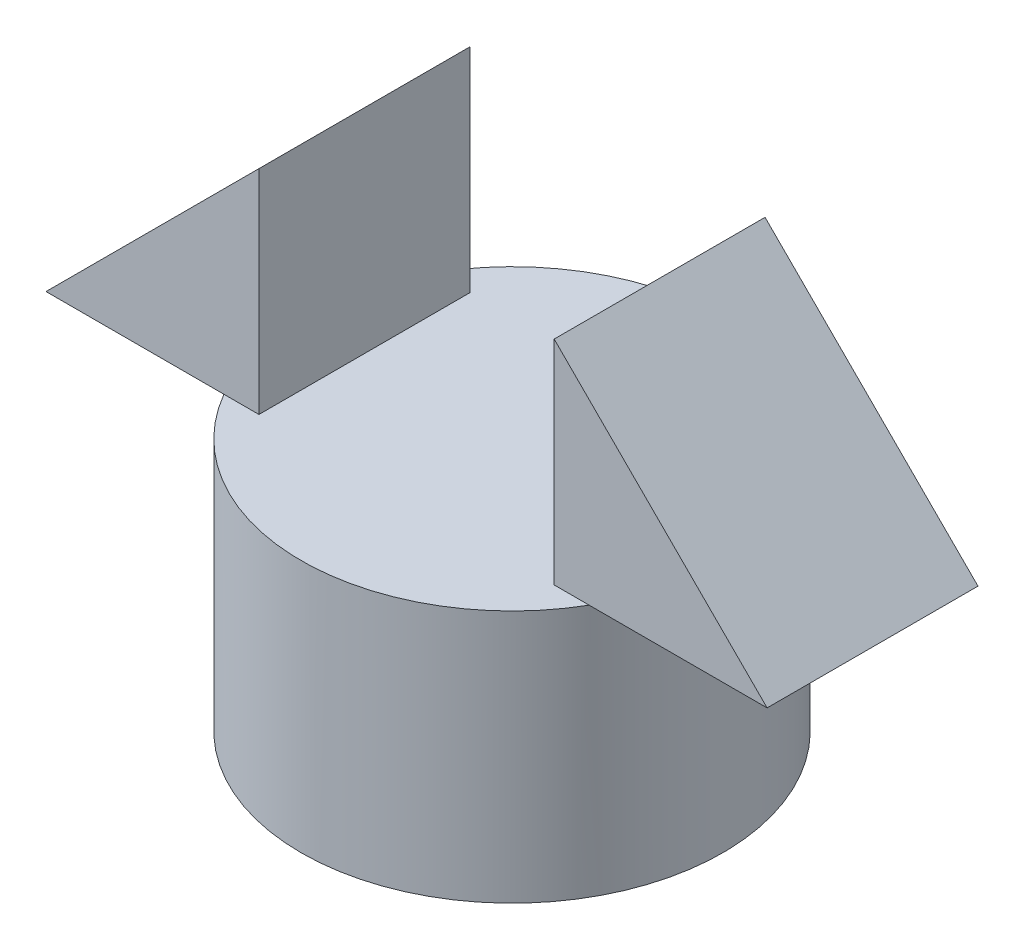
ISO-10303-21;
HEADER;
FILE_DESCRIPTION(('STEP AP214'),'2;1');
FILE_NAME('part.step','',(''),(''),'','','');
FILE_SCHEMA(('AUTOMOTIVE_DESIGN { 1 0 10303 214 1 1 1 1 }'));
ENDSEC;
DATA;
#1=APPLICATION_CONTEXT('core data for automotive mechanical design processes');
#2=APPLICATION_PROTOCOL_DEFINITION('international standard','automotive_design',2000,#1);
#3=PRODUCT_CONTEXT('',#1,'mechanical');
#4=PRODUCT('Part','Part','',(#3));
#5=PRODUCT_RELATED_PRODUCT_CATEGORY('part','',(#4));
#6=PRODUCT_DEFINITION_FORMATION('','',#4);
#7=PRODUCT_DEFINITION_CONTEXT('part definition',#1,'design');
#8=PRODUCT_DEFINITION('design','',#6,#7);
#9=PRODUCT_DEFINITION_SHAPE('','',#8);
#10=(LENGTH_UNIT() NAMED_UNIT(*) SI_UNIT(.MILLI.,.METRE.));
#11=(NAMED_UNIT(*) PLANE_ANGLE_UNIT() SI_UNIT($,.RADIAN.));
#12=(NAMED_UNIT(*) SI_UNIT($,.STERADIAN.) SOLID_ANGLE_UNIT());
#13=UNCERTAINTY_MEASURE_WITH_UNIT(LENGTH_MEASURE(1.E-05),#10,'distance_accuracy_value','');
#14=(GEOMETRIC_REPRESENTATION_CONTEXT(3) GLOBAL_UNCERTAINTY_ASSIGNED_CONTEXT((#13)) GLOBAL_UNIT_ASSIGNED_CONTEXT((#10,
#11,#12)) REPRESENTATION_CONTEXT('',''));
#15=CARTESIAN_POINT('',(0.,0.,0.));
#16=DIRECTION('',(0.,0.,1.));
#17=DIRECTION('',(1.,0.,0.));
#18=AXIS2_PLACEMENT_3D('',#15,#16,#17);
#19=CARTESIAN_POINT('',(0.,0.,12.5));
#20=DIRECTION('',(0.,0.,-1.));
#21=DIRECTION('',(-1.,0.,0.));
#22=AXIS2_PLACEMENT_3D('',#19,#20,#21);
#23=PLANE('',#22);
#24=DIRECTION('',(1.,0.,0.));
#25=VECTOR('',#24,1.);
#26=CARTESIAN_POINT('',(42.7445108461989,30.,12.5));
#27=LINE('',#26,#25);
#28=CARTESIAN_POINT('',(-21.650635094611,30.,12.5));
#29=VERTEX_POINT('',#28);
#30=CARTESIAN_POINT('',(-17.5002559744415,30.,12.5));
#31=VERTEX_POINT('',#30);
#32=EDGE_CURVE('E61',#29,#31,#27,.T.);
#33=ORIENTED_EDGE('',*,*,#32,.T.);
#34=DIRECTION('',(0.,1.,0.));
#35=VECTOR('',#34,1.);
#36=CARTESIAN_POINT('',(-17.5002559744415,0.,12.5));
#37=LINE('',#36,#35);
#38=CARTESIAN_POINT('',(-17.5002559744415,55.2442548717575,12.5));
#39=VERTEX_POINT('',#38);
#40=EDGE_CURVE('E106',#31,#39,#37,.T.);
#41=ORIENTED_EDGE('',*,*,#40,.T.);
#42=DIRECTION('',(-0.707106781186546,-0.707106781186549,0.));
#43=VECTOR('',#42,1.);
#44=CARTESIAN_POINT('',(-42.7445108461989,30.,12.5));
#45=LINE('',#44,#43);
#46=CARTESIAN_POINT('',(-42.7445108461989,30.,12.5));
#47=VERTEX_POINT('',#46);
#48=EDGE_CURVE('E147',#39,#47,#45,.T.);
#49=ORIENTED_EDGE('',*,*,#48,.T.);
#50=EDGE_CURVE('E142',#47,#29,#27,.T.);
#51=ORIENTED_EDGE('',*,*,#50,.T.);
#52=EDGE_LOOP('',(#33,#41,#49,#51));
#53=FACE_BOUND('',#52,.T.);
#54=ADVANCED_FACE('F39',(#53),#23,.F.);
#55=CARTESIAN_POINT('',(0.,0.,-12.5));
#56=DIRECTION('',(0.,0.,-1.));
#57=DIRECTION('',(-1.,0.,0.));
#58=AXIS2_PLACEMENT_3D('',#55,#56,#57);
#59=PLANE('',#58);
#60=DIRECTION('',(0.,1.,0.));
#61=VECTOR('',#60,1.);
#62=CARTESIAN_POINT('',(-17.5002559744415,0.,-12.5));
#63=LINE('',#62,#61);
#64=CARTESIAN_POINT('',(-17.5002559744415,30.,-12.5));
#65=VERTEX_POINT('',#64);
#66=CARTESIAN_POINT('',(-17.5002559744415,55.2442548717575,-12.5));
#67=VERTEX_POINT('',#66);
#68=EDGE_CURVE('E11',#65,#67,#63,.T.);
#69=ORIENTED_EDGE('',*,*,#68,.F.);
#70=DIRECTION('',(1.,0.,0.));
#71=VECTOR('',#70,1.);
#72=CARTESIAN_POINT('',(42.7445108461989,30.,-12.5));
#73=LINE('',#72,#71);
#74=CARTESIAN_POINT('',(-21.650635094611,30.,-12.5));
#75=VERTEX_POINT('',#74);
#76=EDGE_CURVE('E114',#75,#65,#73,.T.);
#77=ORIENTED_EDGE('',*,*,#76,.F.);
#78=CARTESIAN_POINT('',(-42.7445108461989,30.,-12.5));
#79=VERTEX_POINT('',#78);
#80=EDGE_CURVE('E123',#79,#75,#73,.T.);
#81=ORIENTED_EDGE('',*,*,#80,.F.);
#82=DIRECTION('',(-0.707106781186546,-0.707106781186549,0.));
#83=VECTOR('',#82,1.);
#84=CARTESIAN_POINT('',(-42.7445108461989,30.,-12.5));
#85=LINE('',#84,#83);
#86=EDGE_CURVE('E116',#67,#79,#85,.T.);
#87=ORIENTED_EDGE('',*,*,#86,.F.);
#88=EDGE_LOOP('',(#69,#77,#81,#87));
#89=FACE_BOUND('',#88,.T.);
#90=ADVANCED_FACE('F112',(#89),#59,.T.);
#91=CARTESIAN_POINT('',(0.,30.,0.));
#92=DIRECTION('',(0.,-1.,0.));
#93=DIRECTION('',(0.,0.,-1.));
#94=AXIS2_PLACEMENT_3D('',#91,#92,#93);
#95=CYLINDRICAL_SURFACE('',#94,25.);
#96=CARTESIAN_POINT('',(0.,30.,0.));
#97=DIRECTION('',(0.,1.,0.));
#98=DIRECTION('',(0.,0.,1.));
#99=AXIS2_PLACEMENT_3D('',#96,#97,#98);
#100=CIRCLE('',#99,25.);
#101=CARTESIAN_POINT('',(21.650635094611,30.,12.5));
#102=VERTEX_POINT('',#101);
#103=CARTESIAN_POINT('',(21.650635094611,30.,-12.5));
#104=VERTEX_POINT('',#103);
#105=EDGE_CURVE('E170',#102,#104,#100,.T.);
#106=ORIENTED_EDGE('',*,*,#105,.F.);
#107=EDGE_CURVE('E166',#29,#102,#100,.T.);
#108=ORIENTED_EDGE('',*,*,#107,.F.);
#109=EDGE_CURVE('E174',#75,#29,#100,.T.);
#110=ORIENTED_EDGE('',*,*,#109,.F.);
#111=EDGE_CURVE('E119',#104,#75,#100,.T.);
#112=ORIENTED_EDGE('',*,*,#111,.F.);
#113=EDGE_LOOP('',(#106,#108,#110,#112));
#114=FACE_BOUND('',#113,.T.);
#115=CARTESIAN_POINT('',(0.,0.,0.));
#116=DIRECTION('',(0.,1.,0.));
#117=DIRECTION('',(0.,0.,1.));
#118=AXIS2_PLACEMENT_3D('',#115,#116,#117);
#119=CIRCLE('',#118,25.);
#120=CARTESIAN_POINT('',(0.,0.,25.));
#121=VERTEX_POINT('',#120);
#122=EDGE_CURVE('E163',#121,#121,#119,.T.);
#123=ORIENTED_EDGE('',*,*,#122,.T.);
#124=EDGE_LOOP('',(#123));
#125=FACE_BOUND('',#124,.T.);
#126=ADVANCED_FACE('F41',(#114,#125),#95,.T.);
#127=CARTESIAN_POINT('',(0.,30.,0.));
#128=DIRECTION('',(0.,1.,0.));
#129=DIRECTION('',(0.,0.,1.));
#130=AXIS2_PLACEMENT_3D('',#127,#128,#129);
#131=PLANE('',#130);
#132=ORIENTED_EDGE('',*,*,#107,.T.);
#133=CARTESIAN_POINT('',(17.5002559744415,30.,12.5));
#134=VERTEX_POINT('',#133);
#135=EDGE_CURVE('E146',#134,#102,#27,.T.);
#136=ORIENTED_EDGE('',*,*,#135,.F.);
#137=DIRECTION('',(0.,0.,1.));
#138=VECTOR('',#137,1.);
#139=CARTESIAN_POINT('',(17.5002559744415,30.,-19.));
#140=LINE('',#139,#138);
#141=CARTESIAN_POINT('',(17.5002559744415,30.,-12.5));
#142=VERTEX_POINT('',#141);
#143=EDGE_CURVE('E54',#142,#134,#140,.T.);
#144=ORIENTED_EDGE('',*,*,#143,.F.);
#145=EDGE_CURVE('E121',#142,#104,#73,.T.);
#146=ORIENTED_EDGE('',*,*,#145,.T.);
#147=ORIENTED_EDGE('',*,*,#111,.T.);
#148=ORIENTED_EDGE('',*,*,#76,.T.);
#149=DIRECTION('',(0.,0.,1.));
#150=VECTOR('',#149,1.);
#151=CARTESIAN_POINT('',(-17.5002559744415,30.,-19.));
#152=LINE('',#151,#150);
#153=EDGE_CURVE('E101',#65,#31,#152,.T.);
#154=ORIENTED_EDGE('',*,*,#153,.T.);
#155=ORIENTED_EDGE('',*,*,#32,.F.);
#156=EDGE_LOOP('',(#132,#136,#144,#146,#147,#148,#154,#155));
#157=FACE_BOUND('',#156,.T.);
#158=ADVANCED_FACE('F117',(#157),#131,.T.);
#159=CARTESIAN_POINT('',(0.,0.,0.));
#160=DIRECTION('',(0.,1.,0.));
#161=DIRECTION('',(0.,0.,1.));
#162=AXIS2_PLACEMENT_3D('',#159,#160,#161);
#163=PLANE('',#162);
#164=ORIENTED_EDGE('',*,*,#122,.F.);
#165=EDGE_LOOP('',(#164));
#166=FACE_BOUND('',#165,.T.);
#167=ADVANCED_FACE('F222',(#166),#163,.F.);
#168=CARTESIAN_POINT('',(42.7445108461989,30.,12.5));
#169=DIRECTION('',(0.,1.,0.));
#170=DIRECTION('',(0.,0.,1.));
#171=AXIS2_PLACEMENT_3D('',#168,#169,#170);
#172=PLANE('',#171);
#173=CARTESIAN_POINT('',(42.7445108461989,30.,12.5));
#174=VERTEX_POINT('',#173);
#175=EDGE_CURVE('E145',#102,#174,#27,.T.);
#176=ORIENTED_EDGE('',*,*,#175,.F.);
#177=ORIENTED_EDGE('',*,*,#105,.T.);
#178=CARTESIAN_POINT('',(42.7445108461989,30.,-12.5));
#179=VERTEX_POINT('',#178);
#180=EDGE_CURVE('E124',#104,#179,#73,.T.);
#181=ORIENTED_EDGE('',*,*,#180,.T.);
#182=DIRECTION('',(0.,0.,-1.));
#183=VECTOR('',#182,1.);
#184=CARTESIAN_POINT('',(42.7445108461989,30.,12.5));
#185=LINE('',#184,#183);
#186=EDGE_CURVE('E141',#174,#179,#185,.T.);
#187=ORIENTED_EDGE('',*,*,#186,.F.);
#188=EDGE_LOOP('',(#176,#177,#181,#187));
#189=FACE_BOUND('',#188,.T.);
#190=ADVANCED_FACE('F179',(#189),#172,.F.);
#191=ORIENTED_EDGE('',*,*,#80,.T.);
#192=ORIENTED_EDGE('',*,*,#109,.T.);
#193=ORIENTED_EDGE('',*,*,#50,.F.);
#194=DIRECTION('',(0.,0.,-1.));
#195=VECTOR('',#194,1.);
#196=CARTESIAN_POINT('',(-42.7445108461989,30.,12.5));
#197=LINE('',#196,#195);
#198=EDGE_CURVE('E161',#47,#79,#197,.T.);
#199=ORIENTED_EDGE('',*,*,#198,.T.);
#200=EDGE_LOOP('',(#191,#192,#193,#199));
#201=FACE_BOUND('',#200,.T.);
#202=ADVANCED_FACE('F176',(#201),#172,.F.);
#203=CARTESIAN_POINT('',(-42.7445108461989,30.,12.5));
#204=DIRECTION('',(0.707106781186549,-0.707106781186546,0.));
#205=DIRECTION('',(0.707106781186546,0.707106781186549,0.));
#206=AXIS2_PLACEMENT_3D('',#203,#204,#205);
#207=PLANE('',#206);
#208=ORIENTED_EDGE('',*,*,#48,.F.);
#209=DIRECTION('',(0.,0.,1.));
#210=VECTOR('',#209,1.);
#211=CARTESIAN_POINT('',(-17.5002559744415,55.2442548717575,-19.));
#212=LINE('',#211,#210);
#213=EDGE_CURVE('E150',#67,#39,#212,.T.);
#214=ORIENTED_EDGE('',*,*,#213,.F.);
#215=ORIENTED_EDGE('',*,*,#86,.T.);
#216=ORIENTED_EDGE('',*,*,#198,.F.);
#217=EDGE_LOOP('',(#208,#214,#215,#216));
#218=FACE_BOUND('',#217,.T.);
#219=ADVANCED_FACE('F159',(#218),#207,.F.);
#220=CARTESIAN_POINT('',(0.,72.7445108461991,12.5));
#221=DIRECTION('',(-0.707106781186549,-0.707106781186546,0.));
#222=DIRECTION('',(0.707106781186546,-0.707106781186549,0.));
#223=AXIS2_PLACEMENT_3D('',#220,#221,#222);
#224=PLANE('',#223);
#225=DIRECTION('',(-0.707106781186546,0.707106781186549,0.));
#226=VECTOR('',#225,1.);
#227=CARTESIAN_POINT('',(0.,72.7445108461991,-12.5));
#228=LINE('',#227,#226);
#229=CARTESIAN_POINT('',(17.5002559744415,55.2442548717575,-12.5));
#230=VERTEX_POINT('',#229);
#231=EDGE_CURVE('E127',#179,#230,#228,.T.);
#232=ORIENTED_EDGE('',*,*,#231,.T.);
#233=DIRECTION('',(0.,0.,1.));
#234=VECTOR('',#233,1.);
#235=CARTESIAN_POINT('',(17.5002559744415,55.2442548717575,-19.));
#236=LINE('',#235,#234);
#237=CARTESIAN_POINT('',(17.5002559744415,55.2442548717575,12.5));
#238=VERTEX_POINT('',#237);
#239=EDGE_CURVE('E153',#230,#238,#236,.T.);
#240=ORIENTED_EDGE('',*,*,#239,.T.);
#241=DIRECTION('',(-0.707106781186546,0.707106781186549,0.));
#242=VECTOR('',#241,1.);
#243=CARTESIAN_POINT('',(0.,72.7445108461991,12.5));
#244=LINE('',#243,#242);
#245=EDGE_CURVE('E138',#174,#238,#244,.T.);
#246=ORIENTED_EDGE('',*,*,#245,.F.);
#247=ORIENTED_EDGE('',*,*,#186,.T.);
#248=EDGE_LOOP('',(#232,#240,#246,#247));
#249=FACE_BOUND('',#248,.T.);
#250=ADVANCED_FACE('F188',(#249),#224,.F.);
#251=ORIENTED_EDGE('',*,*,#245,.T.);
#252=DIRECTION('',(0.,-1.,0.));
#253=VECTOR('',#252,1.);
#254=CARTESIAN_POINT('',(17.5002559744415,0.,12.5));
#255=LINE('',#254,#253);
#256=EDGE_CURVE('E135',#238,#134,#255,.T.);
#257=ORIENTED_EDGE('',*,*,#256,.T.);
#258=ORIENTED_EDGE('',*,*,#135,.T.);
#259=ORIENTED_EDGE('',*,*,#175,.T.);
#260=EDGE_LOOP('',(#251,#257,#258,#259));
#261=FACE_BOUND('',#260,.T.);
#262=ADVANCED_FACE('F182',(#261),#23,.F.);
#263=DIRECTION('',(0.,-1.,0.));
#264=VECTOR('',#263,1.);
#265=CARTESIAN_POINT('',(17.5002559744415,0.,-12.5));
#266=LINE('',#265,#264);
#267=EDGE_CURVE('E47',#230,#142,#266,.T.);
#268=ORIENTED_EDGE('',*,*,#267,.F.);
#269=ORIENTED_EDGE('',*,*,#231,.F.);
#270=ORIENTED_EDGE('',*,*,#180,.F.);
#271=ORIENTED_EDGE('',*,*,#145,.F.);
#272=EDGE_LOOP('',(#268,#269,#270,#271));
#273=FACE_BOUND('',#272,.T.);
#274=ADVANCED_FACE('F191',(#273),#59,.T.);
#275=CARTESIAN_POINT('',(-17.5002559744415,30.,-19.));
#276=DIRECTION('',(-1.,0.,0.));
#277=DIRECTION('',(0.,0.,1.));
#278=AXIS2_PLACEMENT_3D('',#275,#276,#277);
#279=PLANE('',#278);
#280=ORIENTED_EDGE('',*,*,#153,.F.);
#281=ORIENTED_EDGE('',*,*,#68,.T.);
#282=ORIENTED_EDGE('',*,*,#213,.T.);
#283=ORIENTED_EDGE('',*,*,#40,.F.);
#284=EDGE_LOOP('',(#280,#281,#282,#283));
#285=FACE_BOUND('',#284,.T.);
#286=ADVANCED_FACE('F103',(#285),#279,.F.);
#287=CARTESIAN_POINT('',(17.5002559744415,55.2442548717575,-19.));
#288=DIRECTION('',(1.,0.,0.));
#289=DIRECTION('',(0.,0.,-1.));
#290=AXIS2_PLACEMENT_3D('',#287,#288,#289);
#291=PLANE('',#290);
#292=ORIENTED_EDGE('',*,*,#239,.F.);
#293=ORIENTED_EDGE('',*,*,#267,.T.);
#294=ORIENTED_EDGE('',*,*,#143,.T.);
#295=ORIENTED_EDGE('',*,*,#256,.F.);
#296=EDGE_LOOP('',(#292,#293,#294,#295));
#297=FACE_BOUND('',#296,.T.);
#298=ADVANCED_FACE('F184',(#297),#291,.F.);
#299=CLOSED_SHELL('',(#54,#90,#126,#158,#167,#190,#202,#219,#250,#262,#274,#286,#298));
#300=MANIFOLD_SOLID_BREP('B2',#299);
#301=ADVANCED_BREP_SHAPE_REPRESENTATION('',(#18,#300),#14);
#302=SHAPE_DEFINITION_REPRESENTATION(#9,#301);
ENDSEC;
END-ISO-10303-21;
